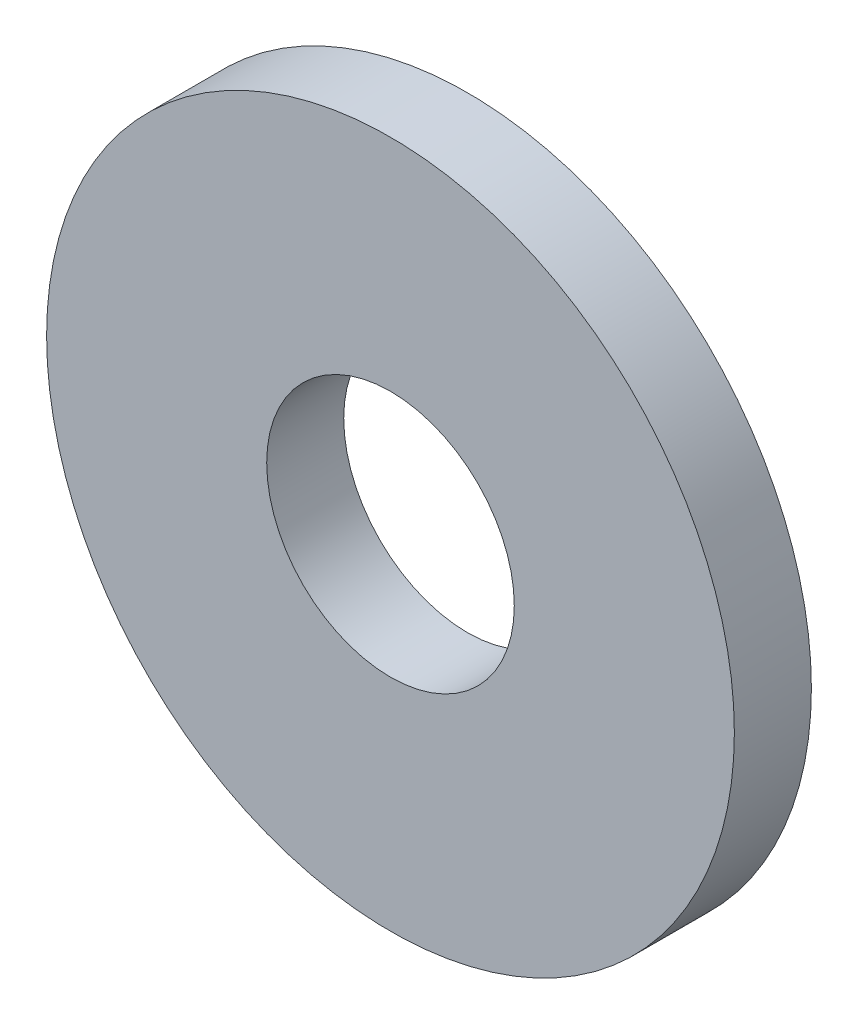
ISO-10303-21;
HEADER;
FILE_DESCRIPTION(('STEP AP214'),'2;1');
FILE_NAME('part.step','',(''),(''),'','','');
FILE_SCHEMA(('AUTOMOTIVE_DESIGN { 1 0 10303 214 1 1 1 1 }'));
ENDSEC;
DATA;
#1=APPLICATION_CONTEXT('core data for automotive mechanical design processes');
#2=APPLICATION_PROTOCOL_DEFINITION('international standard','automotive_design',2000,#1);
#3=PRODUCT_CONTEXT('',#1,'mechanical');
#4=PRODUCT('Part','Part','',(#3));
#5=PRODUCT_RELATED_PRODUCT_CATEGORY('part','',(#4));
#6=PRODUCT_DEFINITION_FORMATION('','',#4);
#7=PRODUCT_DEFINITION_CONTEXT('part definition',#1,'design');
#8=PRODUCT_DEFINITION('design','',#6,#7);
#9=PRODUCT_DEFINITION_SHAPE('','',#8);
#10=(LENGTH_UNIT() NAMED_UNIT(*) SI_UNIT(.MILLI.,.METRE.));
#11=(NAMED_UNIT(*) PLANE_ANGLE_UNIT() SI_UNIT($,.RADIAN.));
#12=(NAMED_UNIT(*) SI_UNIT($,.STERADIAN.) SOLID_ANGLE_UNIT());
#13=UNCERTAINTY_MEASURE_WITH_UNIT(LENGTH_MEASURE(1.E-05),#10,'distance_accuracy_value','');
#14=(GEOMETRIC_REPRESENTATION_CONTEXT(3) GLOBAL_UNCERTAINTY_ASSIGNED_CONTEXT((#13)) GLOBAL_UNIT_ASSIGNED_CONTEXT((#10,
#11,#12)) REPRESENTATION_CONTEXT('',''));
#15=CARTESIAN_POINT('',(0.,0.,0.));
#16=DIRECTION('',(0.,0.,1.));
#17=DIRECTION('',(1.,0.,0.));
#18=AXIS2_PLACEMENT_3D('',#15,#16,#17);
#19=CARTESIAN_POINT('',(0.,0.,2.1336));
#20=DIRECTION('',(0.,0.,1.));
#21=DIRECTION('',(1.,0.,0.));
#22=AXIS2_PLACEMENT_3D('',#19,#20,#21);
#23=PLANE('',#22);
#24=CARTESIAN_POINT('',(0.,0.,2.1336));
#25=DIRECTION('',(0.,0.,1.));
#26=DIRECTION('',(1.,0.,0.));
#27=AXIS2_PLACEMENT_3D('',#24,#25,#26);
#28=CIRCLE('',#27,9.525);
#29=CARTESIAN_POINT('',(9.525,0.,2.1336));
#30=VERTEX_POINT('',#29);
#31=EDGE_CURVE('E10',#30,#30,#28,.T.);
#32=ORIENTED_EDGE('',*,*,#31,.T.);
#33=EDGE_LOOP('',(#32));
#34=FACE_BOUND('',#33,.T.);
#35=CARTESIAN_POINT('',(0.,0.,2.1336));
#36=DIRECTION('',(0.,0.,1.));
#37=DIRECTION('',(1.,0.,0.));
#38=AXIS2_PLACEMENT_3D('',#35,#36,#37);
#39=CIRCLE('',#38,3.429);
#40=CARTESIAN_POINT('',(3.429,0.,2.1336));
#41=VERTEX_POINT('',#40);
#42=EDGE_CURVE('E42',#41,#41,#39,.T.);
#43=ORIENTED_EDGE('',*,*,#42,.F.);
#44=EDGE_LOOP('',(#43));
#45=FACE_BOUND('',#44,.T.);
#46=ADVANCED_FACE('F31',(#34,#45),#23,.T.);
#47=CARTESIAN_POINT('',(0.,0.,0.));
#48=DIRECTION('',(0.,0.,1.));
#49=DIRECTION('',(1.,0.,0.));
#50=AXIS2_PLACEMENT_3D('',#47,#48,#49);
#51=PLANE('',#50);
#52=CARTESIAN_POINT('',(0.,0.,0.));
#53=DIRECTION('',(0.,0.,1.));
#54=DIRECTION('',(1.,0.,0.));
#55=AXIS2_PLACEMENT_3D('',#52,#53,#54);
#56=CIRCLE('',#55,9.525);
#57=CARTESIAN_POINT('',(9.525,0.,0.));
#58=VERTEX_POINT('',#57);
#59=EDGE_CURVE('E35',#58,#58,#56,.T.);
#60=ORIENTED_EDGE('',*,*,#59,.F.);
#61=EDGE_LOOP('',(#60));
#62=FACE_BOUND('',#61,.T.);
#63=CARTESIAN_POINT('',(0.,0.,0.));
#64=DIRECTION('',(0.,0.,1.));
#65=DIRECTION('',(1.,0.,0.));
#66=AXIS2_PLACEMENT_3D('',#63,#64,#65);
#67=CIRCLE('',#66,3.429);
#68=CARTESIAN_POINT('',(3.429,0.,0.));
#69=VERTEX_POINT('',#68);
#70=EDGE_CURVE('E44',#69,#69,#67,.T.);
#71=ORIENTED_EDGE('',*,*,#70,.T.);
#72=EDGE_LOOP('',(#71));
#73=FACE_BOUND('',#72,.T.);
#74=ADVANCED_FACE('F54',(#62,#73),#51,.F.);
#75=CARTESIAN_POINT('',(0.,0.,2.1336));
#76=DIRECTION('',(0.,0.,-1.));
#77=DIRECTION('',(-1.,0.,0.));
#78=AXIS2_PLACEMENT_3D('',#75,#76,#77);
#79=CYLINDRICAL_SURFACE('',#78,9.525);
#80=ORIENTED_EDGE('',*,*,#31,.F.);
#81=EDGE_LOOP('',(#80));
#82=FACE_BOUND('',#81,.T.);
#83=ORIENTED_EDGE('',*,*,#59,.T.);
#84=EDGE_LOOP('',(#83));
#85=FACE_BOUND('',#84,.T.);
#86=ADVANCED_FACE('F33',(#82,#85),#79,.T.);
#87=CARTESIAN_POINT('',(0.,0.,2.1336));
#88=DIRECTION('',(0.,0.,-1.));
#89=DIRECTION('',(-1.,0.,0.));
#90=AXIS2_PLACEMENT_3D('',#87,#88,#89);
#91=CYLINDRICAL_SURFACE('',#90,3.429);
#92=ORIENTED_EDGE('',*,*,#42,.T.);
#93=EDGE_LOOP('',(#92));
#94=FACE_BOUND('',#93,.T.);
#95=ORIENTED_EDGE('',*,*,#70,.F.);
#96=EDGE_LOOP('',(#95));
#97=FACE_BOUND('',#96,.T.);
#98=ADVANCED_FACE('F50',(#94,#97),#91,.F.);
#99=CLOSED_SHELL('',(#46,#74,#86,#98));
#100=MANIFOLD_SOLID_BREP('B2',#99);
#101=ADVANCED_BREP_SHAPE_REPRESENTATION('',(#18,#100),#14);
#102=SHAPE_DEFINITION_REPRESENTATION(#9,#101);
ENDSEC;
END-ISO-10303-21;
